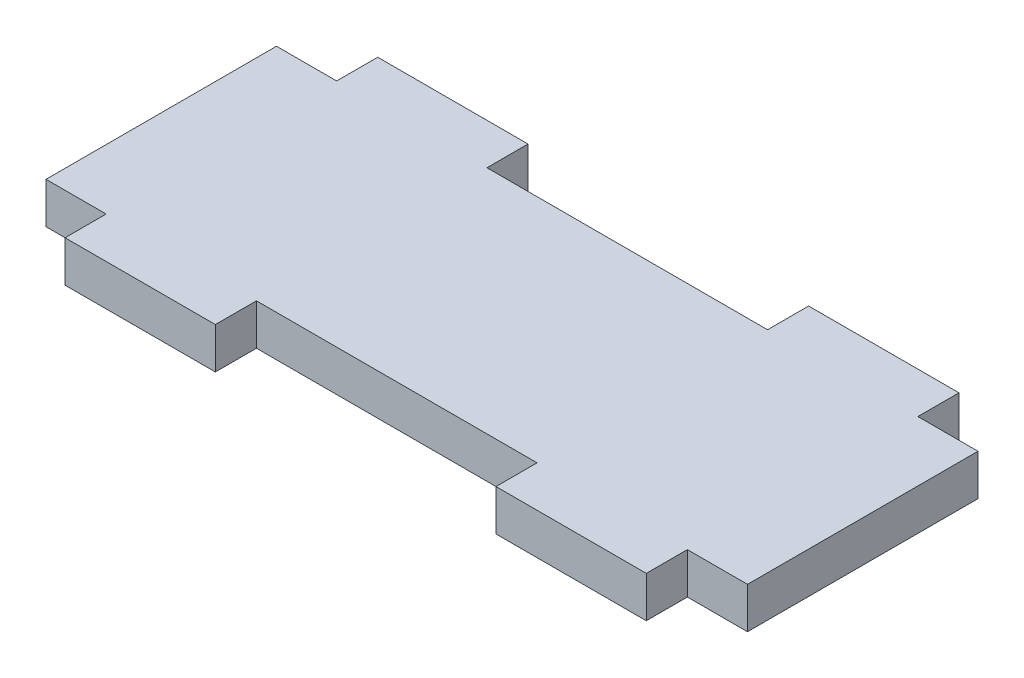
ISO-10303-21;
HEADER;
FILE_DESCRIPTION(('STEP AP214'),'2;1');
FILE_NAME('part.step','',(''),(''),'','','');
FILE_SCHEMA(('AUTOMOTIVE_DESIGN { 1 0 10303 214 1 1 1 1 }'));
ENDSEC;
DATA;
#1=APPLICATION_CONTEXT('core data for automotive mechanical design processes');
#2=APPLICATION_PROTOCOL_DEFINITION('international standard','automotive_design',2000,#1);
#3=PRODUCT_CONTEXT('',#1,'mechanical');
#4=PRODUCT('Part','Part','',(#3));
#5=PRODUCT_RELATED_PRODUCT_CATEGORY('part','',(#4));
#6=PRODUCT_DEFINITION_FORMATION('','',#4);
#7=PRODUCT_DEFINITION_CONTEXT('part definition',#1,'design');
#8=PRODUCT_DEFINITION('design','',#6,#7);
#9=PRODUCT_DEFINITION_SHAPE('','',#8);
#10=(LENGTH_UNIT() NAMED_UNIT(*) SI_UNIT(.MILLI.,.METRE.));
#11=(NAMED_UNIT(*) PLANE_ANGLE_UNIT() SI_UNIT($,.RADIAN.));
#12=(NAMED_UNIT(*) SI_UNIT($,.STERADIAN.) SOLID_ANGLE_UNIT());
#13=UNCERTAINTY_MEASURE_WITH_UNIT(LENGTH_MEASURE(1.E-05),#10,'distance_accuracy_value','');
#14=(GEOMETRIC_REPRESENTATION_CONTEXT(3) GLOBAL_UNCERTAINTY_ASSIGNED_CONTEXT((#13)) GLOBAL_UNIT_ASSIGNED_CONTEXT((#10,
#11,#12)) REPRESENTATION_CONTEXT('',''));
#15=CARTESIAN_POINT('',(0.,0.,0.));
#16=DIRECTION('',(0.,0.,1.));
#17=DIRECTION('',(1.,0.,0.));
#18=AXIS2_PLACEMENT_3D('',#15,#16,#17);
#19=CARTESIAN_POINT('',(6.00000000000001,4.1,0.));
#20=DIRECTION('',(0.,0.,-1.));
#21=DIRECTION('',(-1.,0.,0.));
#22=AXIS2_PLACEMENT_3D('',#19,#20,#21);
#23=PLANE('',#22);
#24=DIRECTION('',(1.,0.,0.));
#25=VECTOR('',#24,1.);
#26=CARTESIAN_POINT('',(6.00000000000001,0.,0.));
#27=LINE('',#26,#25);
#28=CARTESIAN_POINT('',(0.,0.,0.));
#29=VERTEX_POINT('',#28);
#30=CARTESIAN_POINT('',(6.00000000000001,0.,0.));
#31=VERTEX_POINT('',#30);
#32=EDGE_CURVE('E201',#29,#31,#27,.T.);
#33=ORIENTED_EDGE('',*,*,#32,.T.);
#34=DIRECTION('',(0.,-1.,0.));
#35=VECTOR('',#34,1.);
#36=CARTESIAN_POINT('',(6.00000000000001,4.1,0.));
#37=LINE('',#36,#35);
#38=CARTESIAN_POINT('',(6.00000000000001,4.1,0.));
#39=VERTEX_POINT('',#38);
#40=EDGE_CURVE('E11',#39,#31,#37,.T.);
#41=ORIENTED_EDGE('',*,*,#40,.F.);
#42=DIRECTION('',(1.,0.,0.));
#43=VECTOR('',#42,1.);
#44=CARTESIAN_POINT('',(6.00000000000001,4.1,0.));
#45=LINE('',#44,#43);
#46=CARTESIAN_POINT('',(0.,4.1,0.));
#47=VERTEX_POINT('',#46);
#48=EDGE_CURVE('E239',#47,#39,#45,.T.);
#49=ORIENTED_EDGE('',*,*,#48,.F.);
#50=DIRECTION('',(0.,-1.,0.));
#51=VECTOR('',#50,1.);
#52=CARTESIAN_POINT('',(0.,4.1,0.));
#53=LINE('',#52,#51);
#54=EDGE_CURVE('E197',#47,#29,#53,.T.);
#55=ORIENTED_EDGE('',*,*,#54,.T.);
#56=EDGE_LOOP('',(#33,#41,#49,#55));
#57=FACE_BOUND('',#56,.T.);
#58=ADVANCED_FACE('F33',(#57),#23,.F.);
#59=CARTESIAN_POINT('',(6.00000000000001,4.1,0.));
#60=DIRECTION('',(1.,0.,0.));
#61=DIRECTION('',(0.,0.,-1.));
#62=AXIS2_PLACEMENT_3D('',#59,#60,#61);
#63=PLANE('',#62);
#64=DIRECTION('',(0.,0.,1.));
#65=VECTOR('',#64,1.);
#66=CARTESIAN_POINT('',(6.00000000000001,0.,0.));
#67=LINE('',#66,#65);
#68=CARTESIAN_POINT('',(6.00000000000001,0.,4.1));
#69=VERTEX_POINT('',#68);
#70=EDGE_CURVE('E204',#31,#69,#67,.T.);
#71=ORIENTED_EDGE('',*,*,#70,.T.);
#72=DIRECTION('',(0.,-1.,0.));
#73=VECTOR('',#72,1.);
#74=CARTESIAN_POINT('',(6.00000000000001,4.1,4.1));
#75=LINE('',#74,#73);
#76=CARTESIAN_POINT('',(6.00000000000001,4.1,4.1));
#77=VERTEX_POINT('',#76);
#78=EDGE_CURVE('E41',#77,#69,#75,.T.);
#79=ORIENTED_EDGE('',*,*,#78,.F.);
#80=DIRECTION('',(0.,0.,1.));
#81=VECTOR('',#80,1.);
#82=CARTESIAN_POINT('',(6.00000000000001,4.1,0.));
#83=LINE('',#82,#81);
#84=EDGE_CURVE('E128',#39,#77,#83,.T.);
#85=ORIENTED_EDGE('',*,*,#84,.F.);
#86=ORIENTED_EDGE('',*,*,#40,.T.);
#87=EDGE_LOOP('',(#71,#79,#85,#86));
#88=FACE_BOUND('',#87,.T.);
#89=ADVANCED_FACE('F357',(#88),#63,.F.);
#90=CARTESIAN_POINT('',(6.00000000000001,4.1,4.1));
#91=DIRECTION('',(0.,0.,-1.));
#92=DIRECTION('',(-1.,0.,0.));
#93=AXIS2_PLACEMENT_3D('',#90,#91,#92);
#94=PLANE('',#93);
#95=DIRECTION('',(1.,0.,0.));
#96=VECTOR('',#95,1.);
#97=CARTESIAN_POINT('',(6.00000000000001,0.,4.1));
#98=LINE('',#97,#96);
#99=CARTESIAN_POINT('',(21.,0.,4.1));
#100=VERTEX_POINT('',#99);
#101=EDGE_CURVE('E206',#69,#100,#98,.T.);
#102=ORIENTED_EDGE('',*,*,#101,.T.);
#103=DIRECTION('',(0.,-1.,0.));
#104=VECTOR('',#103,1.);
#105=CARTESIAN_POINT('',(21.,4.1,4.1));
#106=LINE('',#105,#104);
#107=CARTESIAN_POINT('',(21.,4.1,4.1));
#108=VERTEX_POINT('',#107);
#109=EDGE_CURVE('E282',#108,#100,#106,.T.);
#110=ORIENTED_EDGE('',*,*,#109,.F.);
#111=DIRECTION('',(1.,0.,0.));
#112=VECTOR('',#111,1.);
#113=CARTESIAN_POINT('',(6.00000000000001,4.1,4.1));
#114=LINE('',#113,#112);
#115=EDGE_CURVE('E290',#77,#108,#114,.T.);
#116=ORIENTED_EDGE('',*,*,#115,.F.);
#117=ORIENTED_EDGE('',*,*,#78,.T.);
#118=EDGE_LOOP('',(#102,#110,#116,#117));
#119=FACE_BOUND('',#118,.T.);
#120=ADVANCED_FACE('F288',(#119),#94,.F.);
#121=CARTESIAN_POINT('',(21.,4.1,0.));
#122=DIRECTION('',(-1.,0.,0.));
#123=DIRECTION('',(0.,0.,1.));
#124=AXIS2_PLACEMENT_3D('',#121,#122,#123);
#125=PLANE('',#124);
#126=DIRECTION('',(0.,0.,-1.));
#127=VECTOR('',#126,1.);
#128=CARTESIAN_POINT('',(21.,0.,0.));
#129=LINE('',#128,#127);
#130=CARTESIAN_POINT('',(21.,0.,0.));
#131=VERTEX_POINT('',#130);
#132=EDGE_CURVE('E208',#100,#131,#129,.T.);
#133=ORIENTED_EDGE('',*,*,#132,.T.);
#134=DIRECTION('',(0.,-1.,0.));
#135=VECTOR('',#134,1.);
#136=CARTESIAN_POINT('',(21.,4.1,0.));
#137=LINE('',#136,#135);
#138=CARTESIAN_POINT('',(21.,4.1,0.));
#139=VERTEX_POINT('',#138);
#140=EDGE_CURVE('E279',#139,#131,#137,.T.);
#141=ORIENTED_EDGE('',*,*,#140,.F.);
#142=DIRECTION('',(0.,0.,-1.));
#143=VECTOR('',#142,1.);
#144=CARTESIAN_POINT('',(21.,4.1,0.));
#145=LINE('',#144,#143);
#146=EDGE_CURVE('E308',#108,#139,#145,.T.);
#147=ORIENTED_EDGE('',*,*,#146,.F.);
#148=ORIENTED_EDGE('',*,*,#109,.T.);
#149=EDGE_LOOP('',(#133,#141,#147,#148));
#150=FACE_BOUND('',#149,.T.);
#151=ADVANCED_FACE('F299',(#150),#125,.F.);
#152=CARTESIAN_POINT('',(21.,4.1,0.));
#153=DIRECTION('',(0.,0.,-1.));
#154=DIRECTION('',(-1.,0.,0.));
#155=AXIS2_PLACEMENT_3D('',#152,#153,#154);
#156=PLANE('',#155);
#157=DIRECTION('',(1.,0.,0.));
#158=VECTOR('',#157,1.);
#159=CARTESIAN_POINT('',(21.,0.,0.));
#160=LINE('',#159,#158);
#161=CARTESIAN_POINT('',(49.,0.,0.));
#162=VERTEX_POINT('',#161);
#163=EDGE_CURVE('E210',#131,#162,#160,.T.);
#164=ORIENTED_EDGE('',*,*,#163,.T.);
#165=DIRECTION('',(0.,-1.,0.));
#166=VECTOR('',#165,1.);
#167=CARTESIAN_POINT('',(49.,4.1,0.));
#168=LINE('',#167,#166);
#169=CARTESIAN_POINT('',(49.,4.1,0.));
#170=VERTEX_POINT('',#169);
#171=EDGE_CURVE('E276',#170,#162,#168,.T.);
#172=ORIENTED_EDGE('',*,*,#171,.F.);
#173=DIRECTION('',(1.,0.,0.));
#174=VECTOR('',#173,1.);
#175=CARTESIAN_POINT('',(21.,4.1,0.));
#176=LINE('',#175,#174);
#177=EDGE_CURVE('E305',#139,#170,#176,.T.);
#178=ORIENTED_EDGE('',*,*,#177,.F.);
#179=ORIENTED_EDGE('',*,*,#140,.T.);
#180=EDGE_LOOP('',(#164,#172,#178,#179));
#181=FACE_BOUND('',#180,.T.);
#182=ADVANCED_FACE('F303',(#181),#156,.F.);
#183=CARTESIAN_POINT('',(49.,4.1,4.09999999999999));
#184=DIRECTION('',(1.,0.,0.));
#185=DIRECTION('',(0.,0.,-1.));
#186=AXIS2_PLACEMENT_3D('',#183,#184,#185);
#187=PLANE('',#186);
#188=DIRECTION('',(0.,0.,1.));
#189=VECTOR('',#188,1.);
#190=CARTESIAN_POINT('',(49.,0.,4.09999999999999));
#191=LINE('',#190,#189);
#192=CARTESIAN_POINT('',(49.,0.,4.09999999999999));
#193=VERTEX_POINT('',#192);
#194=EDGE_CURVE('E212',#162,#193,#191,.T.);
#195=ORIENTED_EDGE('',*,*,#194,.T.);
#196=DIRECTION('',(0.,-1.,0.));
#197=VECTOR('',#196,1.);
#198=CARTESIAN_POINT('',(49.,4.1,4.09999999999999));
#199=LINE('',#198,#197);
#200=CARTESIAN_POINT('',(49.,4.1,4.09999999999999));
#201=VERTEX_POINT('',#200);
#202=EDGE_CURVE('E273',#201,#193,#199,.T.);
#203=ORIENTED_EDGE('',*,*,#202,.F.);
#204=DIRECTION('',(0.,0.,1.));
#205=VECTOR('',#204,1.);
#206=CARTESIAN_POINT('',(49.,4.1,4.09999999999999));
#207=LINE('',#206,#205);
#208=EDGE_CURVE('E307',#170,#201,#207,.T.);
#209=ORIENTED_EDGE('',*,*,#208,.F.);
#210=ORIENTED_EDGE('',*,*,#171,.T.);
#211=EDGE_LOOP('',(#195,#203,#209,#210));
#212=FACE_BOUND('',#211,.T.);
#213=ADVANCED_FACE('F370',(#212),#187,.F.);
#214=CARTESIAN_POINT('',(64.,4.1,4.09999999999999));
#215=DIRECTION('',(0.,0.,-1.));
#216=DIRECTION('',(-1.,0.,0.));
#217=AXIS2_PLACEMENT_3D('',#214,#215,#216);
#218=PLANE('',#217);
#219=DIRECTION('',(1.,0.,0.));
#220=VECTOR('',#219,1.);
#221=CARTESIAN_POINT('',(64.,0.,4.09999999999999));
#222=LINE('',#221,#220);
#223=CARTESIAN_POINT('',(64.,0.,4.09999999999999));
#224=VERTEX_POINT('',#223);
#225=EDGE_CURVE('E214',#193,#224,#222,.T.);
#226=ORIENTED_EDGE('',*,*,#225,.T.);
#227=DIRECTION('',(0.,-1.,0.));
#228=VECTOR('',#227,1.);
#229=CARTESIAN_POINT('',(64.,4.1,4.09999999999999));
#230=LINE('',#229,#228);
#231=CARTESIAN_POINT('',(64.,4.1,4.09999999999999));
#232=VERTEX_POINT('',#231);
#233=EDGE_CURVE('E270',#232,#224,#230,.T.);
#234=ORIENTED_EDGE('',*,*,#233,.F.);
#235=DIRECTION('',(1.,0.,0.));
#236=VECTOR('',#235,1.);
#237=CARTESIAN_POINT('',(64.,4.1,4.09999999999999));
#238=LINE('',#237,#236);
#239=EDGE_CURVE('E310',#201,#232,#238,.T.);
#240=ORIENTED_EDGE('',*,*,#239,.F.);
#241=ORIENTED_EDGE('',*,*,#202,.T.);
#242=EDGE_LOOP('',(#226,#234,#240,#241));
#243=FACE_BOUND('',#242,.T.);
#244=ADVANCED_FACE('F373',(#243),#218,.F.);
#245=CARTESIAN_POINT('',(64.,4.1,4.09999999999999));
#246=DIRECTION('',(-1.,0.,0.));
#247=DIRECTION('',(0.,0.,1.));
#248=AXIS2_PLACEMENT_3D('',#245,#246,#247);
#249=PLANE('',#248);
#250=DIRECTION('',(0.,0.,-1.));
#251=VECTOR('',#250,1.);
#252=CARTESIAN_POINT('',(64.,0.,4.09999999999999));
#253=LINE('',#252,#251);
#254=CARTESIAN_POINT('',(64.,0.,0.));
#255=VERTEX_POINT('',#254);
#256=EDGE_CURVE('E216',#224,#255,#253,.T.);
#257=ORIENTED_EDGE('',*,*,#256,.T.);
#258=DIRECTION('',(0.,-1.,0.));
#259=VECTOR('',#258,1.);
#260=CARTESIAN_POINT('',(64.,4.1,0.));
#261=LINE('',#260,#259);
#262=CARTESIAN_POINT('',(64.,4.1,0.));
#263=VERTEX_POINT('',#262);
#264=EDGE_CURVE('E267',#263,#255,#261,.T.);
#265=ORIENTED_EDGE('',*,*,#264,.F.);
#266=DIRECTION('',(0.,0.,-1.));
#267=VECTOR('',#266,1.);
#268=CARTESIAN_POINT('',(64.,4.1,4.09999999999999));
#269=LINE('',#268,#267);
#270=EDGE_CURVE('E316',#232,#263,#269,.T.);
#271=ORIENTED_EDGE('',*,*,#270,.F.);
#272=ORIENTED_EDGE('',*,*,#233,.T.);
#273=EDGE_LOOP('',(#257,#265,#271,#272));
#274=FACE_BOUND('',#273,.T.);
#275=ADVANCED_FACE('F377',(#274),#249,.F.);
#276=CARTESIAN_POINT('',(64.,4.1,0.));
#277=DIRECTION('',(0.,0.,-1.));
#278=DIRECTION('',(-1.,0.,0.));
#279=AXIS2_PLACEMENT_3D('',#276,#277,#278);
#280=PLANE('',#279);
#281=DIRECTION('',(1.,0.,0.));
#282=VECTOR('',#281,1.);
#283=CARTESIAN_POINT('',(64.,0.,0.));
#284=LINE('',#283,#282);
#285=CARTESIAN_POINT('',(70.,0.,0.));
#286=VERTEX_POINT('',#285);
#287=EDGE_CURVE('E218',#255,#286,#284,.T.);
#288=ORIENTED_EDGE('',*,*,#287,.T.);
#289=DIRECTION('',(0.,-1.,0.));
#290=VECTOR('',#289,1.);
#291=CARTESIAN_POINT('',(70.,4.1,0.));
#292=LINE('',#291,#290);
#293=CARTESIAN_POINT('',(70.,4.1,0.));
#294=VERTEX_POINT('',#293);
#295=EDGE_CURVE('E264',#294,#286,#292,.T.);
#296=ORIENTED_EDGE('',*,*,#295,.F.);
#297=DIRECTION('',(1.,0.,0.));
#298=VECTOR('',#297,1.);
#299=CARTESIAN_POINT('',(64.,4.1,0.));
#300=LINE('',#299,#298);
#301=EDGE_CURVE('E318',#263,#294,#300,.T.);
#302=ORIENTED_EDGE('',*,*,#301,.F.);
#303=ORIENTED_EDGE('',*,*,#264,.T.);
#304=EDGE_LOOP('',(#288,#296,#302,#303));
#305=FACE_BOUND('',#304,.T.);
#306=ADVANCED_FACE('F381',(#305),#280,.F.);
#307=CARTESIAN_POINT('',(70.,4.1,0.));
#308=DIRECTION('',(-1.,0.,0.));
#309=DIRECTION('',(0.,0.,1.));
#310=AXIS2_PLACEMENT_3D('',#307,#308,#309);
#311=PLANE('',#310);
#312=DIRECTION('',(0.,0.,-1.));
#313=VECTOR('',#312,1.);
#314=CARTESIAN_POINT('',(70.,0.,0.));
#315=LINE('',#314,#313);
#316=CARTESIAN_POINT('',(70.,0.,-23.));
#317=VERTEX_POINT('',#316);
#318=EDGE_CURVE('E220',#286,#317,#315,.T.);
#319=ORIENTED_EDGE('',*,*,#318,.T.);
#320=DIRECTION('',(0.,-1.,0.));
#321=VECTOR('',#320,1.);
#322=CARTESIAN_POINT('',(70.,4.1,-23.));
#323=LINE('',#322,#321);
#324=CARTESIAN_POINT('',(70.,4.1,-23.));
#325=VERTEX_POINT('',#324);
#326=EDGE_CURVE('E261',#325,#317,#323,.T.);
#327=ORIENTED_EDGE('',*,*,#326,.F.);
#328=DIRECTION('',(0.,0.,-1.));
#329=VECTOR('',#328,1.);
#330=CARTESIAN_POINT('',(70.,4.1,0.));
#331=LINE('',#330,#329);
#332=EDGE_CURVE('E320',#294,#325,#331,.T.);
#333=ORIENTED_EDGE('',*,*,#332,.F.);
#334=ORIENTED_EDGE('',*,*,#295,.T.);
#335=EDGE_LOOP('',(#319,#327,#333,#334));
#336=FACE_BOUND('',#335,.T.);
#337=ADVANCED_FACE('F385',(#336),#311,.F.);
#338=CARTESIAN_POINT('',(64.,4.1,-23.));
#339=DIRECTION('',(0.,0.,1.));
#340=DIRECTION('',(1.,0.,0.));
#341=AXIS2_PLACEMENT_3D('',#338,#339,#340);
#342=PLANE('',#341);
#343=DIRECTION('',(-1.,0.,0.));
#344=VECTOR('',#343,1.);
#345=CARTESIAN_POINT('',(64.,0.,-23.));
#346=LINE('',#345,#344);
#347=CARTESIAN_POINT('',(64.,0.,-23.));
#348=VERTEX_POINT('',#347);
#349=EDGE_CURVE('E222',#317,#348,#346,.T.);
#350=ORIENTED_EDGE('',*,*,#349,.T.);
#351=DIRECTION('',(0.,-1.,0.));
#352=VECTOR('',#351,1.);
#353=CARTESIAN_POINT('',(64.,4.1,-23.));
#354=LINE('',#353,#352);
#355=CARTESIAN_POINT('',(64.,4.1,-23.));
#356=VERTEX_POINT('',#355);
#357=EDGE_CURVE('E258',#356,#348,#354,.T.);
#358=ORIENTED_EDGE('',*,*,#357,.F.);
#359=DIRECTION('',(-1.,0.,0.));
#360=VECTOR('',#359,1.);
#361=CARTESIAN_POINT('',(64.,4.1,-23.));
#362=LINE('',#361,#360);
#363=EDGE_CURVE('E322',#325,#356,#362,.T.);
#364=ORIENTED_EDGE('',*,*,#363,.F.);
#365=ORIENTED_EDGE('',*,*,#326,.T.);
#366=EDGE_LOOP('',(#350,#358,#364,#365));
#367=FACE_BOUND('',#366,.T.);
#368=ADVANCED_FACE('F389',(#367),#342,.F.);
#369=CARTESIAN_POINT('',(64.,4.1,-27.1));
#370=DIRECTION('',(-1.,0.,0.));
#371=DIRECTION('',(0.,0.,1.));
#372=AXIS2_PLACEMENT_3D('',#369,#370,#371);
#373=PLANE('',#372);
#374=DIRECTION('',(0.,0.,-1.));
#375=VECTOR('',#374,1.);
#376=CARTESIAN_POINT('',(64.,0.,-27.1));
#377=LINE('',#376,#375);
#378=CARTESIAN_POINT('',(64.,0.,-27.1));
#379=VERTEX_POINT('',#378);
#380=EDGE_CURVE('E224',#348,#379,#377,.T.);
#381=ORIENTED_EDGE('',*,*,#380,.T.);
#382=DIRECTION('',(0.,-1.,0.));
#383=VECTOR('',#382,1.);
#384=CARTESIAN_POINT('',(64.,4.1,-27.1));
#385=LINE('',#384,#383);
#386=CARTESIAN_POINT('',(64.,4.1,-27.1));
#387=VERTEX_POINT('',#386);
#388=EDGE_CURVE('E255',#387,#379,#385,.T.);
#389=ORIENTED_EDGE('',*,*,#388,.F.);
#390=DIRECTION('',(0.,0.,-1.));
#391=VECTOR('',#390,1.);
#392=CARTESIAN_POINT('',(64.,4.1,-27.1));
#393=LINE('',#392,#391);
#394=EDGE_CURVE('E324',#356,#387,#393,.T.);
#395=ORIENTED_EDGE('',*,*,#394,.F.);
#396=ORIENTED_EDGE('',*,*,#357,.T.);
#397=EDGE_LOOP('',(#381,#389,#395,#396));
#398=FACE_BOUND('',#397,.T.);
#399=ADVANCED_FACE('F393',(#398),#373,.F.);
#400=CARTESIAN_POINT('',(64.,4.1,-27.1));
#401=DIRECTION('',(0.,0.,1.));
#402=DIRECTION('',(1.,0.,0.));
#403=AXIS2_PLACEMENT_3D('',#400,#401,#402);
#404=PLANE('',#403);
#405=DIRECTION('',(-1.,0.,0.));
#406=VECTOR('',#405,1.);
#407=CARTESIAN_POINT('',(64.,0.,-27.1));
#408=LINE('',#407,#406);
#409=CARTESIAN_POINT('',(49.,0.,-27.1));
#410=VERTEX_POINT('',#409);
#411=EDGE_CURVE('E226',#379,#410,#408,.T.);
#412=ORIENTED_EDGE('',*,*,#411,.T.);
#413=DIRECTION('',(0.,-1.,0.));
#414=VECTOR('',#413,1.);
#415=CARTESIAN_POINT('',(49.,4.1,-27.1));
#416=LINE('',#415,#414);
#417=CARTESIAN_POINT('',(49.,4.1,-27.1));
#418=VERTEX_POINT('',#417);
#419=EDGE_CURVE('E252',#418,#410,#416,.T.);
#420=ORIENTED_EDGE('',*,*,#419,.F.);
#421=DIRECTION('',(-1.,0.,0.));
#422=VECTOR('',#421,1.);
#423=CARTESIAN_POINT('',(64.,4.1,-27.1));
#424=LINE('',#423,#422);
#425=EDGE_CURVE('E326',#387,#418,#424,.T.);
#426=ORIENTED_EDGE('',*,*,#425,.F.);
#427=ORIENTED_EDGE('',*,*,#388,.T.);
#428=EDGE_LOOP('',(#412,#420,#426,#427));
#429=FACE_BOUND('',#428,.T.);
#430=ADVANCED_FACE('F397',(#429),#404,.F.);
#431=CARTESIAN_POINT('',(49.,4.1,-27.1));
#432=DIRECTION('',(1.,0.,0.));
#433=DIRECTION('',(0.,0.,-1.));
#434=AXIS2_PLACEMENT_3D('',#431,#432,#433);
#435=PLANE('',#434);
#436=DIRECTION('',(0.,0.,1.));
#437=VECTOR('',#436,1.);
#438=CARTESIAN_POINT('',(49.,0.,-27.1));
#439=LINE('',#438,#437);
#440=CARTESIAN_POINT('',(49.,0.,-23.));
#441=VERTEX_POINT('',#440);
#442=EDGE_CURVE('E228',#410,#441,#439,.T.);
#443=ORIENTED_EDGE('',*,*,#442,.T.);
#444=DIRECTION('',(0.,-1.,0.));
#445=VECTOR('',#444,1.);
#446=CARTESIAN_POINT('',(49.,4.1,-23.));
#447=LINE('',#446,#445);
#448=CARTESIAN_POINT('',(49.,4.1,-23.));
#449=VERTEX_POINT('',#448);
#450=EDGE_CURVE('E249',#449,#441,#447,.T.);
#451=ORIENTED_EDGE('',*,*,#450,.F.);
#452=DIRECTION('',(0.,0.,1.));
#453=VECTOR('',#452,1.);
#454=CARTESIAN_POINT('',(49.,4.1,-27.1));
#455=LINE('',#454,#453);
#456=EDGE_CURVE('E328',#418,#449,#455,.T.);
#457=ORIENTED_EDGE('',*,*,#456,.F.);
#458=ORIENTED_EDGE('',*,*,#419,.T.);
#459=EDGE_LOOP('',(#443,#451,#457,#458));
#460=FACE_BOUND('',#459,.T.);
#461=ADVANCED_FACE('F401',(#460),#435,.F.);
#462=CARTESIAN_POINT('',(21.,4.1,-23.));
#463=DIRECTION('',(0.,0.,1.));
#464=DIRECTION('',(1.,0.,0.));
#465=AXIS2_PLACEMENT_3D('',#462,#463,#464);
#466=PLANE('',#465);
#467=DIRECTION('',(-1.,0.,0.));
#468=VECTOR('',#467,1.);
#469=CARTESIAN_POINT('',(21.,0.,-23.));
#470=LINE('',#469,#468);
#471=CARTESIAN_POINT('',(21.,0.,-23.));
#472=VERTEX_POINT('',#471);
#473=EDGE_CURVE('E230',#441,#472,#470,.T.);
#474=ORIENTED_EDGE('',*,*,#473,.T.);
#475=DIRECTION('',(0.,-1.,0.));
#476=VECTOR('',#475,1.);
#477=CARTESIAN_POINT('',(21.,4.1,-23.));
#478=LINE('',#477,#476);
#479=CARTESIAN_POINT('',(21.,4.1,-23.));
#480=VERTEX_POINT('',#479);
#481=EDGE_CURVE('E246',#480,#472,#478,.T.);
#482=ORIENTED_EDGE('',*,*,#481,.F.);
#483=DIRECTION('',(-1.,0.,0.));
#484=VECTOR('',#483,1.);
#485=CARTESIAN_POINT('',(21.,4.1,-23.));
#486=LINE('',#485,#484);
#487=EDGE_CURVE('E330',#449,#480,#486,.T.);
#488=ORIENTED_EDGE('',*,*,#487,.F.);
#489=ORIENTED_EDGE('',*,*,#450,.T.);
#490=EDGE_LOOP('',(#474,#482,#488,#489));
#491=FACE_BOUND('',#490,.T.);
#492=ADVANCED_FACE('F405',(#491),#466,.F.);
#493=CARTESIAN_POINT('',(21.,4.1,-23.));
#494=DIRECTION('',(-1.,0.,0.));
#495=DIRECTION('',(0.,0.,1.));
#496=AXIS2_PLACEMENT_3D('',#493,#494,#495);
#497=PLANE('',#496);
#498=DIRECTION('',(0.,0.,-1.));
#499=VECTOR('',#498,1.);
#500=CARTESIAN_POINT('',(21.,0.,-23.));
#501=LINE('',#500,#499);
#502=CARTESIAN_POINT('',(21.,0.,-27.1));
#503=VERTEX_POINT('',#502);
#504=EDGE_CURVE('E232',#472,#503,#501,.T.);
#505=ORIENTED_EDGE('',*,*,#504,.T.);
#506=DIRECTION('',(0.,-1.,0.));
#507=VECTOR('',#506,1.);
#508=CARTESIAN_POINT('',(21.,4.1,-27.1));
#509=LINE('',#508,#507);
#510=CARTESIAN_POINT('',(21.,4.1,-27.1));
#511=VERTEX_POINT('',#510);
#512=EDGE_CURVE('E243',#511,#503,#509,.T.);
#513=ORIENTED_EDGE('',*,*,#512,.F.);
#514=DIRECTION('',(0.,0.,-1.));
#515=VECTOR('',#514,1.);
#516=CARTESIAN_POINT('',(21.,4.1,-23.));
#517=LINE('',#516,#515);
#518=EDGE_CURVE('E332',#480,#511,#517,.T.);
#519=ORIENTED_EDGE('',*,*,#518,.F.);
#520=ORIENTED_EDGE('',*,*,#481,.T.);
#521=EDGE_LOOP('',(#505,#513,#519,#520));
#522=FACE_BOUND('',#521,.T.);
#523=ADVANCED_FACE('F338',(#522),#497,.F.);
#524=CARTESIAN_POINT('',(6.00000000000001,4.1,-27.1));
#525=DIRECTION('',(0.,0.,1.));
#526=DIRECTION('',(1.,0.,0.));
#527=AXIS2_PLACEMENT_3D('',#524,#525,#526);
#528=PLANE('',#527);
#529=DIRECTION('',(-1.,0.,0.));
#530=VECTOR('',#529,1.);
#531=CARTESIAN_POINT('',(6.00000000000001,0.,-27.1));
#532=LINE('',#531,#530);
#533=CARTESIAN_POINT('',(6.00000000000001,0.,-27.1));
#534=VERTEX_POINT('',#533);
#535=EDGE_CURVE('E234',#503,#534,#532,.T.);
#536=ORIENTED_EDGE('',*,*,#535,.T.);
#537=DIRECTION('',(0.,-1.,0.));
#538=VECTOR('',#537,1.);
#539=CARTESIAN_POINT('',(6.00000000000001,4.1,-27.1));
#540=LINE('',#539,#538);
#541=CARTESIAN_POINT('',(6.00000000000001,4.1,-27.1));
#542=VERTEX_POINT('',#541);
#543=EDGE_CURVE('E192',#542,#534,#540,.T.);
#544=ORIENTED_EDGE('',*,*,#543,.F.);
#545=DIRECTION('',(-1.,0.,0.));
#546=VECTOR('',#545,1.);
#547=CARTESIAN_POINT('',(6.00000000000001,4.1,-27.1));
#548=LINE('',#547,#546);
#549=EDGE_CURVE('E183',#511,#542,#548,.T.);
#550=ORIENTED_EDGE('',*,*,#549,.F.);
#551=ORIENTED_EDGE('',*,*,#512,.T.);
#552=EDGE_LOOP('',(#536,#544,#550,#551));
#553=FACE_BOUND('',#552,.T.);
#554=ADVANCED_FACE('F342',(#553),#528,.F.);
#555=CARTESIAN_POINT('',(6.00000000000001,4.1,-23.));
#556=DIRECTION('',(1.,0.,0.));
#557=DIRECTION('',(0.,0.,-1.));
#558=AXIS2_PLACEMENT_3D('',#555,#556,#557);
#559=PLANE('',#558);
#560=DIRECTION('',(0.,0.,1.));
#561=VECTOR('',#560,1.);
#562=CARTESIAN_POINT('',(6.00000000000001,0.,-23.));
#563=LINE('',#562,#561);
#564=CARTESIAN_POINT('',(6.00000000000001,0.,-23.));
#565=VERTEX_POINT('',#564);
#566=EDGE_CURVE('E191',#534,#565,#563,.T.);
#567=ORIENTED_EDGE('',*,*,#566,.T.);
#568=DIRECTION('',(0.,-1.,0.));
#569=VECTOR('',#568,1.);
#570=CARTESIAN_POINT('',(6.00000000000001,4.1,-23.));
#571=LINE('',#570,#569);
#572=CARTESIAN_POINT('',(6.00000000000001,4.1,-23.));
#573=VERTEX_POINT('',#572);
#574=EDGE_CURVE('E188',#573,#565,#571,.T.);
#575=ORIENTED_EDGE('',*,*,#574,.F.);
#576=DIRECTION('',(0.,0.,1.));
#577=VECTOR('',#576,1.);
#578=CARTESIAN_POINT('',(6.00000000000001,4.1,-23.));
#579=LINE('',#578,#577);
#580=EDGE_CURVE('E177',#542,#573,#579,.T.);
#581=ORIENTED_EDGE('',*,*,#580,.F.);
#582=ORIENTED_EDGE('',*,*,#543,.T.);
#583=EDGE_LOOP('',(#567,#575,#581,#582));
#584=FACE_BOUND('',#583,.T.);
#585=ADVANCED_FACE('F189',(#584),#559,.F.);
#586=CARTESIAN_POINT('',(6.00000000000001,4.1,-23.));
#587=DIRECTION('',(0.,0.,1.));
#588=DIRECTION('',(1.,0.,0.));
#589=AXIS2_PLACEMENT_3D('',#586,#587,#588);
#590=PLANE('',#589);
#591=DIRECTION('',(-1.,0.,0.));
#592=VECTOR('',#591,1.);
#593=CARTESIAN_POINT('',(6.00000000000001,0.,-23.));
#594=LINE('',#593,#592);
#595=CARTESIAN_POINT('',(0.,0.,-23.));
#596=VERTEX_POINT('',#595);
#597=EDGE_CURVE('E114',#565,#596,#594,.T.);
#598=ORIENTED_EDGE('',*,*,#597,.T.);
#599=DIRECTION('',(0.,-1.,0.));
#600=VECTOR('',#599,1.);
#601=CARTESIAN_POINT('',(0.,4.1,-23.));
#602=LINE('',#601,#600);
#603=CARTESIAN_POINT('',(0.,4.1,-23.));
#604=VERTEX_POINT('',#603);
#605=EDGE_CURVE('E193',#604,#596,#602,.T.);
#606=ORIENTED_EDGE('',*,*,#605,.F.);
#607=DIRECTION('',(-1.,0.,0.));
#608=VECTOR('',#607,1.);
#609=CARTESIAN_POINT('',(6.00000000000001,4.1,-23.));
#610=LINE('',#609,#608);
#611=EDGE_CURVE('E181',#573,#604,#610,.T.);
#612=ORIENTED_EDGE('',*,*,#611,.F.);
#613=ORIENTED_EDGE('',*,*,#574,.T.);
#614=EDGE_LOOP('',(#598,#606,#612,#613));
#615=FACE_BOUND('',#614,.T.);
#616=ADVANCED_FACE('F195',(#615),#590,.F.);
#617=CARTESIAN_POINT('',(0.,4.1,0.));
#618=DIRECTION('',(1.,0.,0.));
#619=DIRECTION('',(0.,0.,-1.));
#620=AXIS2_PLACEMENT_3D('',#617,#618,#619);
#621=PLANE('',#620);
#622=DIRECTION('',(0.,0.,1.));
#623=VECTOR('',#622,1.);
#624=CARTESIAN_POINT('',(0.,0.,0.));
#625=LINE('',#624,#623);
#626=EDGE_CURVE('E120',#596,#29,#625,.T.);
#627=ORIENTED_EDGE('',*,*,#626,.T.);
#628=ORIENTED_EDGE('',*,*,#54,.F.);
#629=DIRECTION('',(0.,0.,1.));
#630=VECTOR('',#629,1.);
#631=CARTESIAN_POINT('',(0.,4.1,0.));
#632=LINE('',#631,#630);
#633=EDGE_CURVE('E49',#604,#47,#632,.T.);
#634=ORIENTED_EDGE('',*,*,#633,.F.);
#635=ORIENTED_EDGE('',*,*,#605,.T.);
#636=EDGE_LOOP('',(#627,#628,#634,#635));
#637=FACE_BOUND('',#636,.T.);
#638=ADVANCED_FACE('F346',(#637),#621,.F.);
#639=CARTESIAN_POINT('',(0.,4.1,0.));
#640=DIRECTION('',(0.,-1.,0.));
#641=DIRECTION('',(0.,0.,-1.));
#642=AXIS2_PLACEMENT_3D('',#639,#640,#641);
#643=PLANE('',#642);
#644=ORIENTED_EDGE('',*,*,#48,.T.);
#645=ORIENTED_EDGE('',*,*,#84,.T.);
#646=ORIENTED_EDGE('',*,*,#115,.T.);
#647=ORIENTED_EDGE('',*,*,#146,.T.);
#648=ORIENTED_EDGE('',*,*,#177,.T.);
#649=ORIENTED_EDGE('',*,*,#208,.T.);
#650=ORIENTED_EDGE('',*,*,#239,.T.);
#651=ORIENTED_EDGE('',*,*,#270,.T.);
#652=ORIENTED_EDGE('',*,*,#301,.T.);
#653=ORIENTED_EDGE('',*,*,#332,.T.);
#654=ORIENTED_EDGE('',*,*,#363,.T.);
#655=ORIENTED_EDGE('',*,*,#394,.T.);
#656=ORIENTED_EDGE('',*,*,#425,.T.);
#657=ORIENTED_EDGE('',*,*,#456,.T.);
#658=ORIENTED_EDGE('',*,*,#487,.T.);
#659=ORIENTED_EDGE('',*,*,#518,.T.);
#660=ORIENTED_EDGE('',*,*,#549,.T.);
#661=ORIENTED_EDGE('',*,*,#580,.T.);
#662=ORIENTED_EDGE('',*,*,#611,.T.);
#663=ORIENTED_EDGE('',*,*,#633,.T.);
#664=EDGE_LOOP('',(#644,#645,#646,#647,#648,#649,#650,#651,#652,#653,#654,#655,#656,#657,#658,
#659,#660,#661,#662,#663));
#665=FACE_BOUND('',#664,.T.);
#666=ADVANCED_FACE('F179',(#665),#643,.F.);
#667=CARTESIAN_POINT('',(0.,0.,0.));
#668=DIRECTION('',(0.,-1.,0.));
#669=DIRECTION('',(0.,0.,-1.));
#670=AXIS2_PLACEMENT_3D('',#667,#668,#669);
#671=PLANE('',#670);
#672=ORIENTED_EDGE('',*,*,#32,.F.);
#673=ORIENTED_EDGE('',*,*,#626,.F.);
#674=ORIENTED_EDGE('',*,*,#597,.F.);
#675=ORIENTED_EDGE('',*,*,#566,.F.);
#676=ORIENTED_EDGE('',*,*,#535,.F.);
#677=ORIENTED_EDGE('',*,*,#504,.F.);
#678=ORIENTED_EDGE('',*,*,#473,.F.);
#679=ORIENTED_EDGE('',*,*,#442,.F.);
#680=ORIENTED_EDGE('',*,*,#411,.F.);
#681=ORIENTED_EDGE('',*,*,#380,.F.);
#682=ORIENTED_EDGE('',*,*,#349,.F.);
#683=ORIENTED_EDGE('',*,*,#318,.F.);
#684=ORIENTED_EDGE('',*,*,#287,.F.);
#685=ORIENTED_EDGE('',*,*,#256,.F.);
#686=ORIENTED_EDGE('',*,*,#225,.F.);
#687=ORIENTED_EDGE('',*,*,#194,.F.);
#688=ORIENTED_EDGE('',*,*,#163,.F.);
#689=ORIENTED_EDGE('',*,*,#132,.F.);
#690=ORIENTED_EDGE('',*,*,#101,.F.);
#691=ORIENTED_EDGE('',*,*,#70,.F.);
#692=EDGE_LOOP('',(#672,#673,#674,#675,#676,#677,#678,#679,#680,#681,#682,#683,#684,#685,#686,
#687,#688,#689,#690,#691));
#693=FACE_BOUND('',#692,.T.);
#694=ADVANCED_FACE('F294',(#693),#671,.T.);
#695=CLOSED_SHELL('',(#58,#89,#120,#151,#182,#213,#244,#275,#306,#337,#368,#399,#430,#461,#492,
#523,#554,#585,#616,#638,#666,#694));
#696=MANIFOLD_SOLID_BREP('B2',#695);
#697=ADVANCED_BREP_SHAPE_REPRESENTATION('',(#18,#696),#14);
#698=SHAPE_DEFINITION_REPRESENTATION(#9,#697);
ENDSEC;
END-ISO-10303-21;
